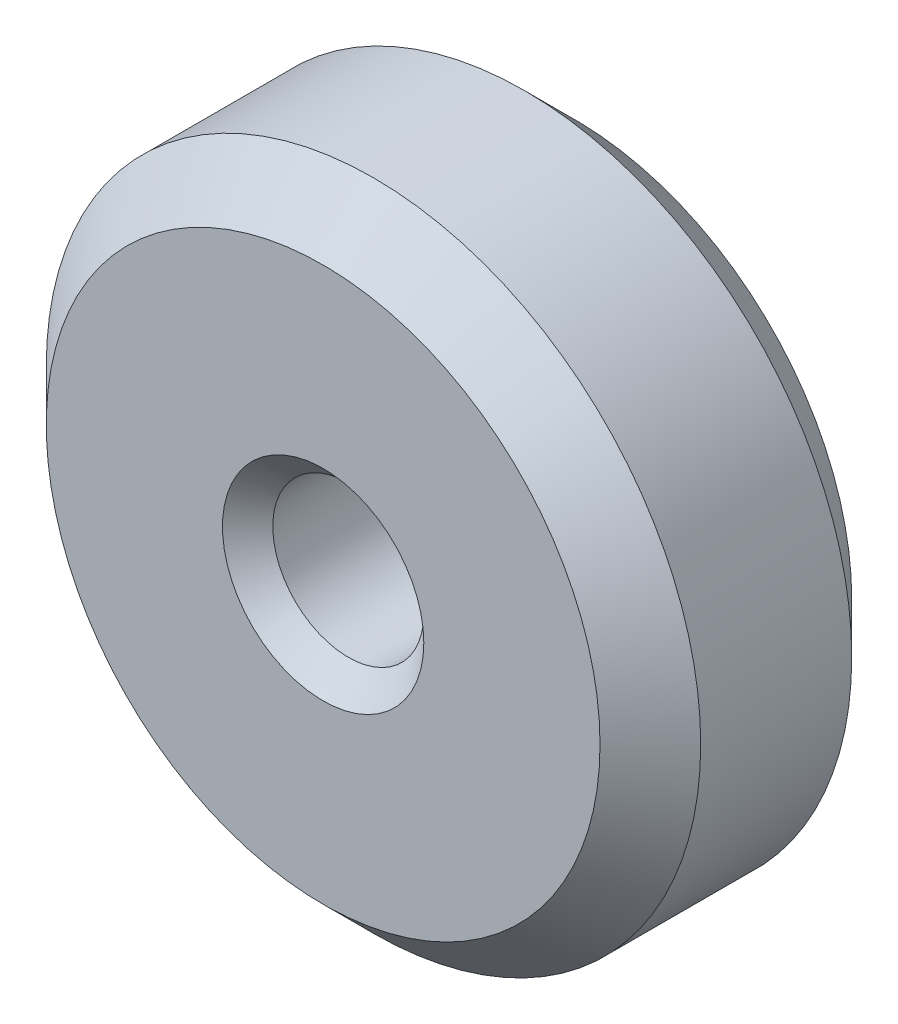
ISO-10303-21;
HEADER;
FILE_DESCRIPTION(('STEP AP214'),'2;1');
FILE_NAME('part.step','',(''),(''),'','','');
FILE_SCHEMA(('AUTOMOTIVE_DESIGN { 1 0 10303 214 1 1 1 1 }'));
ENDSEC;
DATA;
#1=APPLICATION_CONTEXT('core data for automotive mechanical design processes');
#2=APPLICATION_PROTOCOL_DEFINITION('international standard','automotive_design',2000,#1);
#3=PRODUCT_CONTEXT('',#1,'mechanical');
#4=PRODUCT('Part','Part','',(#3));
#5=PRODUCT_RELATED_PRODUCT_CATEGORY('part','',(#4));
#6=PRODUCT_DEFINITION_FORMATION('','',#4);
#7=PRODUCT_DEFINITION_CONTEXT('part definition',#1,'design');
#8=PRODUCT_DEFINITION('design','',#6,#7);
#9=PRODUCT_DEFINITION_SHAPE('','',#8);
#10=(LENGTH_UNIT() NAMED_UNIT(*) SI_UNIT(.MILLI.,.METRE.));
#11=(NAMED_UNIT(*) PLANE_ANGLE_UNIT() SI_UNIT($,.RADIAN.));
#12=(NAMED_UNIT(*) SI_UNIT($,.STERADIAN.) SOLID_ANGLE_UNIT());
#13=UNCERTAINTY_MEASURE_WITH_UNIT(LENGTH_MEASURE(1.E-05),#10,'distance_accuracy_value','');
#14=(GEOMETRIC_REPRESENTATION_CONTEXT(3) GLOBAL_UNCERTAINTY_ASSIGNED_CONTEXT((#13)) GLOBAL_UNIT_ASSIGNED_CONTEXT((#10,
#11,#12)) REPRESENTATION_CONTEXT('',''));
#15=CARTESIAN_POINT('',(0.,0.,0.));
#16=DIRECTION('',(0.,0.,1.));
#17=DIRECTION('',(1.,0.,0.));
#18=AXIS2_PLACEMENT_3D('',#15,#16,#17);
#19=CARTESIAN_POINT('',(0.,0.,5.));
#20=DIRECTION('',(0.,0.,1.));
#21=DIRECTION('',(1.,0.,0.));
#22=AXIS2_PLACEMENT_3D('',#19,#20,#21);
#23=PLANE('',#22);
#24=CARTESIAN_POINT('',(0.,0.,5.));
#25=DIRECTION('',(0.,0.,1.));
#26=DIRECTION('',(1.,0.,0.));
#27=AXIS2_PLACEMENT_3D('',#24,#25,#26);
#28=CIRCLE('',#27,2.00000000000001);
#29=CARTESIAN_POINT('',(2.00000000000001,0.,5.));
#30=VERTEX_POINT('',#29);
#31=EDGE_CURVE('E10',#30,#30,#28,.F.);
#32=ORIENTED_EDGE('',*,*,#31,.T.);
#33=EDGE_LOOP('',(#32));
#34=FACE_BOUND('',#33,.T.);
#35=CARTESIAN_POINT('',(0.,0.,5.));
#36=DIRECTION('',(0.,0.,1.));
#37=DIRECTION('',(1.,0.,0.));
#38=AXIS2_PLACEMENT_3D('',#35,#36,#37);
#39=CIRCLE('',#38,5.5);
#40=CARTESIAN_POINT('',(5.5,0.,5.));
#41=VERTEX_POINT('',#40);
#42=EDGE_CURVE('E57',#41,#41,#39,.T.);
#43=ORIENTED_EDGE('',*,*,#42,.T.);
#44=EDGE_LOOP('',(#43));
#45=FACE_BOUND('',#44,.T.);
#46=ADVANCED_FACE('F36',(#34,#45),#23,.T.);
#47=CARTESIAN_POINT('',(0.,0.,0.));
#48=DIRECTION('',(0.,0.,1.));
#49=DIRECTION('',(1.,0.,0.));
#50=AXIS2_PLACEMENT_3D('',#47,#48,#49);
#51=PLANE('',#50);
#52=CARTESIAN_POINT('',(0.,0.,0.));
#53=DIRECTION('',(0.,0.,1.));
#54=DIRECTION('',(1.,0.,0.));
#55=AXIS2_PLACEMENT_3D('',#52,#53,#54);
#56=CIRCLE('',#55,2.);
#57=CARTESIAN_POINT('',(2.,0.,0.));
#58=VERTEX_POINT('',#57);
#59=EDGE_CURVE('E52',#58,#58,#56,.T.);
#60=ORIENTED_EDGE('',*,*,#59,.T.);
#61=EDGE_LOOP('',(#60));
#62=FACE_BOUND('',#61,.T.);
#63=CARTESIAN_POINT('',(0.,0.,0.));
#64=DIRECTION('',(0.,0.,1.));
#65=DIRECTION('',(1.,0.,0.));
#66=AXIS2_PLACEMENT_3D('',#63,#64,#65);
#67=CIRCLE('',#66,5.5);
#68=CARTESIAN_POINT('',(5.5,0.,0.));
#69=VERTEX_POINT('',#68);
#70=EDGE_CURVE('E60',#69,#69,#67,.F.);
#71=ORIENTED_EDGE('',*,*,#70,.T.);
#72=EDGE_LOOP('',(#71));
#73=FACE_BOUND('',#72,.T.);
#74=ADVANCED_FACE('F81',(#62,#73),#51,.F.);
#75=CARTESIAN_POINT('',(0.,0.,5.));
#76=DIRECTION('',(0.,0.,-1.));
#77=DIRECTION('',(-1.,0.,0.));
#78=AXIS2_PLACEMENT_3D('',#75,#76,#77);
#79=CYLINDRICAL_SURFACE('',#78,6.5);
#80=CARTESIAN_POINT('',(0.,0.,0.999999999999998));
#81=DIRECTION('',(0.,0.,1.));
#82=DIRECTION('',(1.,0.,0.));
#83=AXIS2_PLACEMENT_3D('',#80,#81,#82);
#84=CIRCLE('',#83,6.5);
#85=CARTESIAN_POINT('',(6.5,0.,0.999999999999998));
#86=VERTEX_POINT('',#85);
#87=EDGE_CURVE('E63',#86,#86,#84,.T.);
#88=ORIENTED_EDGE('',*,*,#87,.T.);
#89=EDGE_LOOP('',(#88));
#90=FACE_BOUND('',#89,.T.);
#91=CARTESIAN_POINT('',(0.,0.,4.));
#92=DIRECTION('',(0.,0.,1.));
#93=DIRECTION('',(1.,0.,0.));
#94=AXIS2_PLACEMENT_3D('',#91,#92,#93);
#95=CIRCLE('',#94,6.5);
#96=CARTESIAN_POINT('',(6.5,0.,4.));
#97=VERTEX_POINT('',#96);
#98=EDGE_CURVE('E66',#97,#97,#95,.F.);
#99=ORIENTED_EDGE('',*,*,#98,.T.);
#100=EDGE_LOOP('',(#99));
#101=FACE_BOUND('',#100,.T.);
#102=ADVANCED_FACE('F70',(#90,#101),#79,.T.);
#103=CARTESIAN_POINT('',(0.,0.,5.));
#104=DIRECTION('',(0.,0.,-1.));
#105=DIRECTION('',(-1.,0.,0.));
#106=AXIS2_PLACEMENT_3D('',#103,#104,#105);
#107=CYLINDRICAL_SURFACE('',#106,1.5);
#108=CARTESIAN_POINT('',(0.,0.,0.500000000000001));
#109=DIRECTION('',(0.,0.,1.));
#110=DIRECTION('',(1.,0.,0.));
#111=AXIS2_PLACEMENT_3D('',#108,#109,#110);
#112=CIRCLE('',#111,1.5);
#113=CARTESIAN_POINT('',(1.5,0.,0.500000000000001));
#114=VERTEX_POINT('',#113);
#115=EDGE_CURVE('E44',#114,#114,#112,.F.);
#116=ORIENTED_EDGE('',*,*,#115,.T.);
#117=EDGE_LOOP('',(#116));
#118=FACE_BOUND('',#117,.T.);
#119=CARTESIAN_POINT('',(0.,0.,4.49999999999999));
#120=DIRECTION('',(0.,0.,1.));
#121=DIRECTION('',(1.,0.,0.));
#122=AXIS2_PLACEMENT_3D('',#119,#120,#121);
#123=CIRCLE('',#122,1.5);
#124=CARTESIAN_POINT('',(1.5,0.,4.49999999999999));
#125=VERTEX_POINT('',#124);
#126=EDGE_CURVE('E48',#125,#125,#123,.T.);
#127=ORIENTED_EDGE('',*,*,#126,.T.);
#128=EDGE_LOOP('',(#127));
#129=FACE_BOUND('',#128,.T.);
#130=ADVANCED_FACE('F89',(#118,#129),#107,.F.);
#131=CARTESIAN_POINT('',(0.,0.,0.999999999999998));
#132=DIRECTION('',(0.,0.,1.));
#133=DIRECTION('',(1.,0.,0.));
#134=AXIS2_PLACEMENT_3D('',#131,#132,#133);
#135=CONICAL_SURFACE('',#134,6.5,0.78539816339745);
#136=ORIENTED_EDGE('',*,*,#70,.F.);
#137=EDGE_LOOP('',(#136));
#138=FACE_BOUND('',#137,.T.);
#139=ORIENTED_EDGE('',*,*,#87,.F.);
#140=EDGE_LOOP('',(#139));
#141=FACE_BOUND('',#140,.T.);
#142=ADVANCED_FACE('F76',(#138,#141),#135,.T.);
#143=CARTESIAN_POINT('',(0.,0.,5.));
#144=DIRECTION('',(0.,0.,-1.));
#145=DIRECTION('',(-1.,0.,0.));
#146=AXIS2_PLACEMENT_3D('',#143,#144,#145);
#147=CONICAL_SURFACE('',#146,5.5,0.785398163397445);
#148=ORIENTED_EDGE('',*,*,#98,.F.);
#149=EDGE_LOOP('',(#148));
#150=FACE_BOUND('',#149,.T.);
#151=ORIENTED_EDGE('',*,*,#42,.F.);
#152=EDGE_LOOP('',(#151));
#153=FACE_BOUND('',#152,.T.);
#154=ADVANCED_FACE('F72',(#150,#153),#147,.T.);
#155=CARTESIAN_POINT('',(0.,0.,0.));
#156=DIRECTION('',(0.,0.,-1.));
#157=DIRECTION('',(-1.,0.,0.));
#158=AXIS2_PLACEMENT_3D('',#155,#156,#157);
#159=CONICAL_SURFACE('',#158,2.,0.785398163397445);
#160=ORIENTED_EDGE('',*,*,#115,.F.);
#161=EDGE_LOOP('',(#160));
#162=FACE_BOUND('',#161,.T.);
#163=ORIENTED_EDGE('',*,*,#59,.F.);
#164=EDGE_LOOP('',(#163));
#165=FACE_BOUND('',#164,.T.);
#166=ADVANCED_FACE('F75',(#162,#165),#159,.F.);
#167=CARTESIAN_POINT('',(0.,0.,4.49999999999999));
#168=DIRECTION('',(0.,0.,1.));
#169=DIRECTION('',(1.,0.,0.));
#170=AXIS2_PLACEMENT_3D('',#167,#168,#169);
#171=CONICAL_SURFACE('',#170,1.5,0.785398163397448);
#172=ORIENTED_EDGE('',*,*,#31,.F.);
#173=EDGE_LOOP('',(#172));
#174=FACE_BOUND('',#173,.T.);
#175=ORIENTED_EDGE('',*,*,#126,.F.);
#176=EDGE_LOOP('',(#175));
#177=FACE_BOUND('',#176,.T.);
#178=ADVANCED_FACE('F39',(#174,#177),#171,.F.);
#179=CLOSED_SHELL('',(#46,#74,#102,#130,#142,#154,#166,#178));
#180=MANIFOLD_SOLID_BREP('B2',#179);
#181=ADVANCED_BREP_SHAPE_REPRESENTATION('',(#18,#180),#14);
#182=SHAPE_DEFINITION_REPRESENTATION(#9,#181);
ENDSEC;
END-ISO-10303-21;
